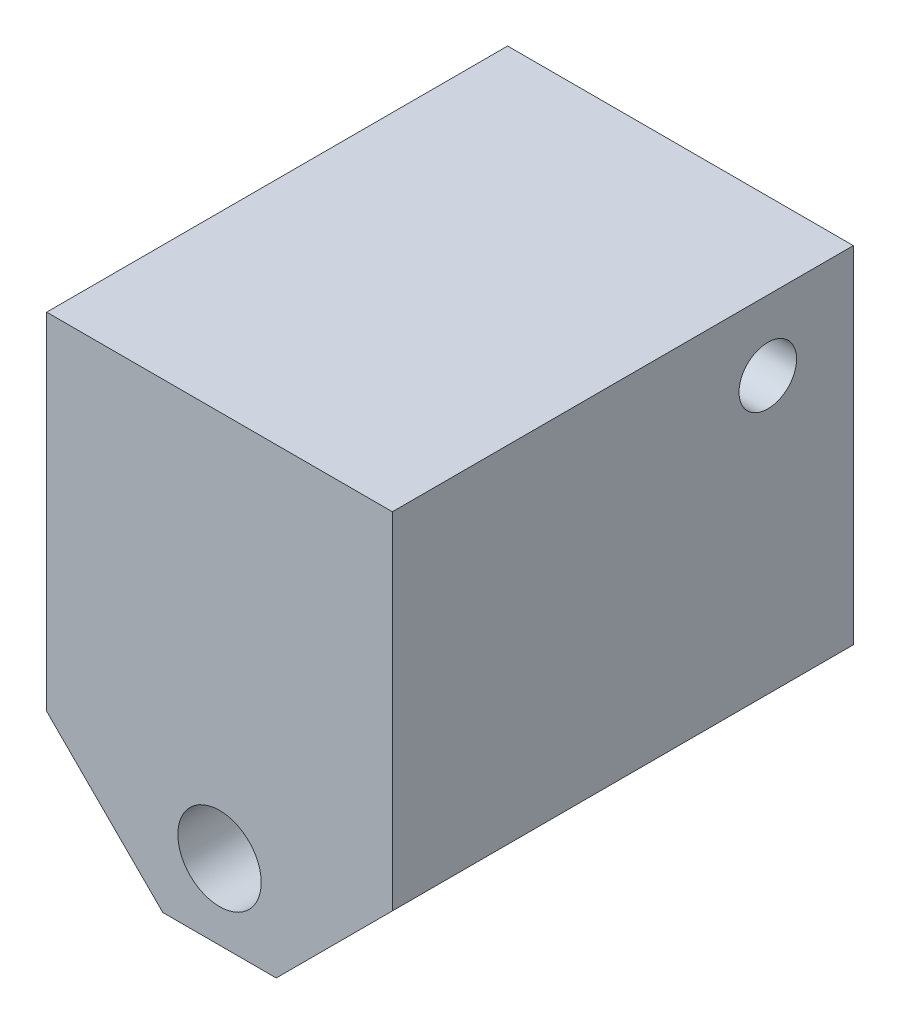
ISO-10303-21;
HEADER;
FILE_DESCRIPTION(('STEP AP214'),'2;1');
FILE_NAME('part.step','',(''),(''),'','','');
FILE_SCHEMA(('AUTOMOTIVE_DESIGN { 1 0 10303 214 1 1 1 1 }'));
ENDSEC;
DATA;
#1=APPLICATION_CONTEXT('core data for automotive mechanical design processes');
#2=APPLICATION_PROTOCOL_DEFINITION('international standard','automotive_design',2000,#1);
#3=PRODUCT_CONTEXT('',#1,'mechanical');
#4=PRODUCT('Part','Part','',(#3));
#5=PRODUCT_RELATED_PRODUCT_CATEGORY('part','',(#4));
#6=PRODUCT_DEFINITION_FORMATION('','',#4);
#7=PRODUCT_DEFINITION_CONTEXT('part definition',#1,'design');
#8=PRODUCT_DEFINITION('design','',#6,#7);
#9=PRODUCT_DEFINITION_SHAPE('','',#8);
#10=(LENGTH_UNIT() NAMED_UNIT(*) SI_UNIT(.MILLI.,.METRE.));
#11=(NAMED_UNIT(*) PLANE_ANGLE_UNIT() SI_UNIT($,.RADIAN.));
#12=(NAMED_UNIT(*) SI_UNIT($,.STERADIAN.) SOLID_ANGLE_UNIT());
#13=UNCERTAINTY_MEASURE_WITH_UNIT(LENGTH_MEASURE(1.E-05),#10,'distance_accuracy_value','');
#14=(GEOMETRIC_REPRESENTATION_CONTEXT(3) GLOBAL_UNCERTAINTY_ASSIGNED_CONTEXT((#13)) GLOBAL_UNIT_ASSIGNED_CONTEXT((#10,
#11,#12)) REPRESENTATION_CONTEXT('',''));
#15=CARTESIAN_POINT('',(0.,0.,0.));
#16=DIRECTION('',(0.,0.,1.));
#17=DIRECTION('',(1.,0.,0.));
#18=AXIS2_PLACEMENT_3D('',#15,#16,#17);
#19=CARTESIAN_POINT('',(0.,0.,40.));
#20=DIRECTION('',(0.,0.,-1.));
#21=DIRECTION('',(-1.,0.,0.));
#22=AXIS2_PLACEMENT_3D('',#19,#20,#21);
#23=PLANE('',#22);
#24=DIRECTION('',(0.707106781186547,0.707106781186548,0.));
#25=VECTOR('',#24,1.);
#26=CARTESIAN_POINT('',(4.92232691174685,-25.0776730882532,40.));
#27=LINE('',#26,#25);
#28=CARTESIAN_POINT('',(4.92232691174685,-25.0776730882532,40.));
#29=VERTEX_POINT('',#28);
#30=CARTESIAN_POINT('',(15.,-15.,40.));
#31=VERTEX_POINT('',#30);
#32=EDGE_CURVE('E128',#29,#31,#27,.T.);
#33=ORIENTED_EDGE('',*,*,#32,.T.);
#34=DIRECTION('',(0.,1.,0.));
#35=VECTOR('',#34,1.);
#36=CARTESIAN_POINT('',(15.,15.,40.));
#37=LINE('',#36,#35);
#38=CARTESIAN_POINT('',(15.,15.,40.));
#39=VERTEX_POINT('',#38);
#40=EDGE_CURVE('E86',#31,#39,#37,.T.);
#41=ORIENTED_EDGE('',*,*,#40,.T.);
#42=DIRECTION('',(-1.,0.,0.));
#43=VECTOR('',#42,1.);
#44=CARTESIAN_POINT('',(-15.,15.,40.));
#45=LINE('',#44,#43);
#46=CARTESIAN_POINT('',(-15.,15.,40.));
#47=VERTEX_POINT('',#46);
#48=EDGE_CURVE('E99',#39,#47,#45,.T.);
#49=ORIENTED_EDGE('',*,*,#48,.T.);
#50=DIRECTION('',(0.,-1.,0.));
#51=VECTOR('',#50,1.);
#52=CARTESIAN_POINT('',(-15.,15.,40.));
#53=LINE('',#52,#51);
#54=CARTESIAN_POINT('',(-15.,-15.,40.));
#55=VERTEX_POINT('',#54);
#56=EDGE_CURVE('E93',#47,#55,#53,.T.);
#57=ORIENTED_EDGE('',*,*,#56,.T.);
#58=DIRECTION('',(0.707106781186548,-0.707106781186547,0.));
#59=VECTOR('',#58,1.);
#60=CARTESIAN_POINT('',(-15.,-15.,40.));
#61=LINE('',#60,#59);
#62=CARTESIAN_POINT('',(-4.92232691174684,-25.0776730882532,40.));
#63=VERTEX_POINT('',#62);
#64=EDGE_CURVE('E97',#55,#63,#61,.T.);
#65=ORIENTED_EDGE('',*,*,#64,.T.);
#66=DIRECTION('',(1.,0.,0.));
#67=VECTOR('',#66,1.);
#68=CARTESIAN_POINT('',(-4.92232691174684,-25.0776730882532,40.));
#69=LINE('',#68,#67);
#70=EDGE_CURVE('E49',#63,#29,#69,.T.);
#71=ORIENTED_EDGE('',*,*,#70,.T.);
#72=EDGE_LOOP('',(#33,#41,#49,#57,#65,#71));
#73=FACE_BOUND('',#72,.T.);
#74=CARTESIAN_POINT('',(0.,-18.5556521867289,40.));
#75=DIRECTION('',(0.,0.,1.));
#76=DIRECTION('',(1.,0.,0.));
#77=AXIS2_PLACEMENT_3D('',#74,#75,#76);
#78=CIRCLE('',#77,3.61713687726905);
#79=CARTESIAN_POINT('',(3.61713687726905,-18.5556521867289,40.));
#80=VERTEX_POINT('',#79);
#81=EDGE_CURVE('E121',#80,#80,#78,.T.);
#82=ORIENTED_EDGE('',*,*,#81,.F.);
#83=EDGE_LOOP('',(#82));
#84=FACE_BOUND('',#83,.T.);
#85=ADVANCED_FACE('F32',(#73,#84),#23,.F.);
#86=CARTESIAN_POINT('',(0.,0.,0.));
#87=DIRECTION('',(0.,0.,-1.));
#88=DIRECTION('',(-1.,0.,0.));
#89=AXIS2_PLACEMENT_3D('',#86,#87,#88);
#90=PLANE('',#89);
#91=DIRECTION('',(0.707106781186547,0.707106781186548,0.));
#92=VECTOR('',#91,1.);
#93=CARTESIAN_POINT('',(4.92232691174685,-25.0776730882532,0.));
#94=LINE('',#93,#92);
#95=CARTESIAN_POINT('',(4.92232691174685,-25.0776730882532,0.));
#96=VERTEX_POINT('',#95);
#97=CARTESIAN_POINT('',(15.,-15.,0.));
#98=VERTEX_POINT('',#97);
#99=EDGE_CURVE('E117',#96,#98,#94,.T.);
#100=ORIENTED_EDGE('',*,*,#99,.F.);
#101=DIRECTION('',(1.,0.,0.));
#102=VECTOR('',#101,1.);
#103=CARTESIAN_POINT('',(-4.92232691174684,-25.0776730882532,0.));
#104=LINE('',#103,#102);
#105=CARTESIAN_POINT('',(-4.92232691174684,-25.0776730882532,0.));
#106=VERTEX_POINT('',#105);
#107=EDGE_CURVE('E78',#106,#96,#104,.T.);
#108=ORIENTED_EDGE('',*,*,#107,.F.);
#109=DIRECTION('',(0.707106781186548,-0.707106781186547,0.));
#110=VECTOR('',#109,1.);
#111=CARTESIAN_POINT('',(-15.,-15.,0.));
#112=LINE('',#111,#110);
#113=CARTESIAN_POINT('',(-15.,-15.,0.));
#114=VERTEX_POINT('',#113);
#115=EDGE_CURVE('E72',#114,#106,#112,.T.);
#116=ORIENTED_EDGE('',*,*,#115,.F.);
#117=DIRECTION('',(0.,-1.,0.));
#118=VECTOR('',#117,1.);
#119=CARTESIAN_POINT('',(-15.,15.,0.));
#120=LINE('',#119,#118);
#121=CARTESIAN_POINT('',(-15.,15.,0.));
#122=VERTEX_POINT('',#121);
#123=EDGE_CURVE('E107',#122,#114,#120,.T.);
#124=ORIENTED_EDGE('',*,*,#123,.F.);
#125=DIRECTION('',(-1.,0.,0.));
#126=VECTOR('',#125,1.);
#127=CARTESIAN_POINT('',(-15.,15.,0.));
#128=LINE('',#127,#126);
#129=CARTESIAN_POINT('',(15.,15.,0.));
#130=VERTEX_POINT('',#129);
#131=EDGE_CURVE('E123',#130,#122,#128,.T.);
#132=ORIENTED_EDGE('',*,*,#131,.F.);
#133=DIRECTION('',(0.,1.,0.));
#134=VECTOR('',#133,1.);
#135=CARTESIAN_POINT('',(15.,15.,0.));
#136=LINE('',#135,#134);
#137=EDGE_CURVE('E120',#98,#130,#136,.T.);
#138=ORIENTED_EDGE('',*,*,#137,.F.);
#139=EDGE_LOOP('',(#100,#108,#116,#124,#132,#138));
#140=FACE_BOUND('',#139,.T.);
#141=CARTESIAN_POINT('',(0.,-18.5556521867289,0.));
#142=DIRECTION('',(0.,0.,1.));
#143=DIRECTION('',(1.,0.,0.));
#144=AXIS2_PLACEMENT_3D('',#141,#142,#143);
#145=CIRCLE('',#144,3.61713687726905);
#146=CARTESIAN_POINT('',(3.61713687726905,-18.5556521867289,0.));
#147=VERTEX_POINT('',#146);
#148=EDGE_CURVE('E174',#147,#147,#145,.T.);
#149=ORIENTED_EDGE('',*,*,#148,.T.);
#150=EDGE_LOOP('',(#149));
#151=FACE_BOUND('',#150,.T.);
#152=ADVANCED_FACE('F137',(#140,#151),#90,.T.);
#153=CARTESIAN_POINT('',(4.92232691174685,-25.0776730882532,40.));
#154=DIRECTION('',(-0.707106781186548,0.707106781186547,0.));
#155=DIRECTION('',(-0.707106781186547,-0.707106781186548,0.));
#156=AXIS2_PLACEMENT_3D('',#153,#154,#155);
#157=PLANE('',#156);
#158=ORIENTED_EDGE('',*,*,#99,.T.);
#159=DIRECTION('',(0.,0.,-1.));
#160=VECTOR('',#159,1.);
#161=CARTESIAN_POINT('',(15.,-15.,40.));
#162=LINE('',#161,#160);
#163=EDGE_CURVE('E11',#31,#98,#162,.T.);
#164=ORIENTED_EDGE('',*,*,#163,.F.);
#165=ORIENTED_EDGE('',*,*,#32,.F.);
#166=DIRECTION('',(0.,0.,-1.));
#167=VECTOR('',#166,1.);
#168=CARTESIAN_POINT('',(4.92232691174685,-25.0776730882532,40.));
#169=LINE('',#168,#167);
#170=EDGE_CURVE('E113',#29,#96,#169,.T.);
#171=ORIENTED_EDGE('',*,*,#170,.T.);
#172=EDGE_LOOP('',(#158,#164,#165,#171));
#173=FACE_BOUND('',#172,.T.);
#174=ADVANCED_FACE('F34',(#173),#157,.F.);
#175=CARTESIAN_POINT('',(15.,15.,40.));
#176=DIRECTION('',(-1.,0.,0.));
#177=DIRECTION('',(0.,-1.,0.));
#178=AXIS2_PLACEMENT_3D('',#175,#176,#177);
#179=PLANE('',#178);
#180=CARTESIAN_POINT('',(15.,8.94186057742274,7.42320161036503));
#181=DIRECTION('',(1.,0.,0.));
#182=DIRECTION('',(0.,0.,-1.));
#183=AXIS2_PLACEMENT_3D('',#180,#181,#182);
#184=CIRCLE('',#183,2.49999999999999);
#185=CARTESIAN_POINT('',(15.,8.94186057742274,4.92320161036503));
#186=VERTEX_POINT('',#185);
#187=EDGE_CURVE('E171',#186,#186,#184,.T.);
#188=ORIENTED_EDGE('',*,*,#187,.F.);
#189=EDGE_LOOP('',(#188));
#190=FACE_BOUND('',#189,.T.);
#191=ORIENTED_EDGE('',*,*,#137,.T.);
#192=DIRECTION('',(0.,0.,-1.));
#193=VECTOR('',#192,1.);
#194=CARTESIAN_POINT('',(15.,15.,40.));
#195=LINE('',#194,#193);
#196=EDGE_CURVE('E41',#39,#130,#195,.T.);
#197=ORIENTED_EDGE('',*,*,#196,.F.);
#198=ORIENTED_EDGE('',*,*,#40,.F.);
#199=ORIENTED_EDGE('',*,*,#163,.T.);
#200=EDGE_LOOP('',(#191,#197,#198,#199));
#201=FACE_BOUND('',#200,.T.);
#202=ADVANCED_FACE('F191',(#190,#201),#179,.F.);
#203=CARTESIAN_POINT('',(-15.,15.,40.));
#204=DIRECTION('',(0.,-1.,0.));
#205=DIRECTION('',(0.,0.,-1.));
#206=AXIS2_PLACEMENT_3D('',#203,#204,#205);
#207=PLANE('',#206);
#208=ORIENTED_EDGE('',*,*,#131,.T.);
#209=DIRECTION('',(0.,0.,-1.));
#210=VECTOR('',#209,1.);
#211=CARTESIAN_POINT('',(-15.,15.,40.));
#212=LINE('',#211,#210);
#213=EDGE_CURVE('E108',#47,#122,#212,.T.);
#214=ORIENTED_EDGE('',*,*,#213,.F.);
#215=ORIENTED_EDGE('',*,*,#48,.F.);
#216=ORIENTED_EDGE('',*,*,#196,.T.);
#217=EDGE_LOOP('',(#208,#214,#215,#216));
#218=FACE_BOUND('',#217,.T.);
#219=ADVANCED_FACE('F134',(#218),#207,.F.);
#220=CARTESIAN_POINT('',(-15.,15.,40.));
#221=DIRECTION('',(1.,0.,0.));
#222=DIRECTION('',(0.,1.,0.));
#223=AXIS2_PLACEMENT_3D('',#220,#221,#222);
#224=PLANE('',#223);
#225=CARTESIAN_POINT('',(-15.,8.94186057742274,7.42320161036503));
#226=DIRECTION('',(1.,0.,0.));
#227=DIRECTION('',(0.,0.,-1.));
#228=AXIS2_PLACEMENT_3D('',#225,#226,#227);
#229=CIRCLE('',#228,2.49999999999999);
#230=CARTESIAN_POINT('',(-15.,8.94186057742274,4.92320161036504));
#231=VERTEX_POINT('',#230);
#232=EDGE_CURVE('E168',#231,#231,#229,.T.);
#233=ORIENTED_EDGE('',*,*,#232,.T.);
#234=EDGE_LOOP('',(#233));
#235=FACE_BOUND('',#234,.T.);
#236=ORIENTED_EDGE('',*,*,#123,.T.);
#237=DIRECTION('',(0.,0.,-1.));
#238=VECTOR('',#237,1.);
#239=CARTESIAN_POINT('',(-15.,-15.,40.));
#240=LINE('',#239,#238);
#241=EDGE_CURVE('E104',#55,#114,#240,.T.);
#242=ORIENTED_EDGE('',*,*,#241,.F.);
#243=ORIENTED_EDGE('',*,*,#56,.F.);
#244=ORIENTED_EDGE('',*,*,#213,.T.);
#245=EDGE_LOOP('',(#236,#242,#243,#244));
#246=FACE_BOUND('',#245,.T.);
#247=ADVANCED_FACE('F105',(#235,#246),#224,.F.);
#248=CARTESIAN_POINT('',(-15.,-15.,40.));
#249=DIRECTION('',(0.707106781186547,0.707106781186548,0.));
#250=DIRECTION('',(-0.707106781186548,0.707106781186547,0.));
#251=AXIS2_PLACEMENT_3D('',#248,#249,#250);
#252=PLANE('',#251);
#253=ORIENTED_EDGE('',*,*,#115,.T.);
#254=DIRECTION('',(0.,0.,-1.));
#255=VECTOR('',#254,1.);
#256=CARTESIAN_POINT('',(-4.92232691174684,-25.0776730882532,40.));
#257=LINE('',#256,#255);
#258=EDGE_CURVE('E109',#63,#106,#257,.T.);
#259=ORIENTED_EDGE('',*,*,#258,.F.);
#260=ORIENTED_EDGE('',*,*,#64,.F.);
#261=ORIENTED_EDGE('',*,*,#241,.T.);
#262=EDGE_LOOP('',(#253,#259,#260,#261));
#263=FACE_BOUND('',#262,.T.);
#264=ADVANCED_FACE('F111',(#263),#252,.F.);
#265=CARTESIAN_POINT('',(-4.92232691174684,-25.0776730882532,40.));
#266=DIRECTION('',(0.,1.,0.));
#267=DIRECTION('',(0.,0.,1.));
#268=AXIS2_PLACEMENT_3D('',#265,#266,#267);
#269=PLANE('',#268);
#270=ORIENTED_EDGE('',*,*,#107,.T.);
#271=ORIENTED_EDGE('',*,*,#170,.F.);
#272=ORIENTED_EDGE('',*,*,#70,.F.);
#273=ORIENTED_EDGE('',*,*,#258,.T.);
#274=EDGE_LOOP('',(#270,#271,#272,#273));
#275=FACE_BOUND('',#274,.T.);
#276=ADVANCED_FACE('F142',(#275),#269,.F.);
#277=CARTESIAN_POINT('',(0.,-18.5556521867289,40.));
#278=DIRECTION('',(0.,0.,-1.));
#279=DIRECTION('',(-1.,0.,0.));
#280=AXIS2_PLACEMENT_3D('',#277,#278,#279);
#281=CYLINDRICAL_SURFACE('',#280,3.61713687726905);
#282=ORIENTED_EDGE('',*,*,#81,.T.);
#283=EDGE_LOOP('',(#282));
#284=FACE_BOUND('',#283,.T.);
#285=ORIENTED_EDGE('',*,*,#148,.F.);
#286=EDGE_LOOP('',(#285));
#287=FACE_BOUND('',#286,.T.);
#288=ADVANCED_FACE('F144',(#284,#287),#281,.F.);
#289=CARTESIAN_POINT('',(15.,8.94186057742274,7.42320161036503));
#290=DIRECTION('',(1.,0.,0.));
#291=DIRECTION('',(0.,0.,-1.));
#292=AXIS2_PLACEMENT_3D('',#289,#290,#291);
#293=CYLINDRICAL_SURFACE('',#292,2.49999999999999);
#294=ORIENTED_EDGE('',*,*,#232,.F.);
#295=EDGE_LOOP('',(#294));
#296=FACE_BOUND('',#295,.T.);
#297=ORIENTED_EDGE('',*,*,#187,.T.);
#298=EDGE_LOOP('',(#297));
#299=FACE_BOUND('',#298,.T.);
#300=ADVANCED_FACE('F150',(#296,#299),#293,.F.);
#301=CLOSED_SHELL('',(#85,#152,#174,#202,#219,#247,#264,#276,#288,#300));
#302=MANIFOLD_SOLID_BREP('B2',#301);
#303=ADVANCED_BREP_SHAPE_REPRESENTATION('',(#18,#302),#14);
#304=SHAPE_DEFINITION_REPRESENTATION(#9,#303);
ENDSEC;
END-ISO-10303-21;
